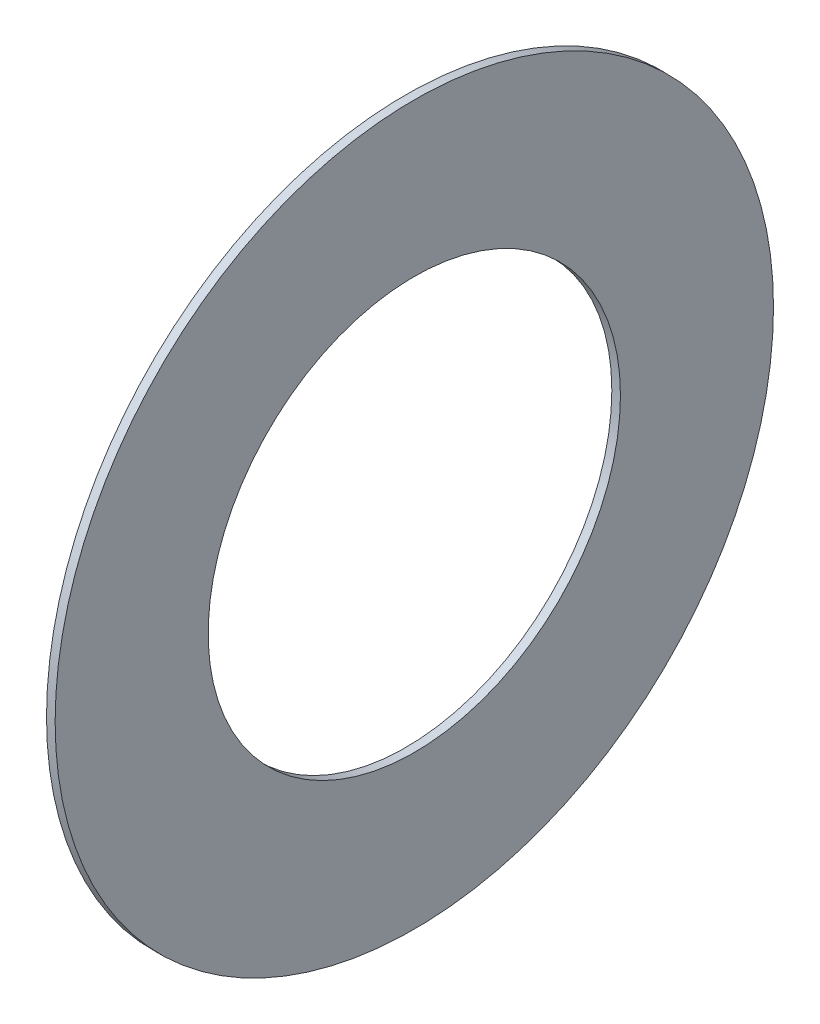
ISO-10303-21;
HEADER;
FILE_DESCRIPTION(('STEP AP214'),'2;1');
FILE_NAME('part.step','',(''),(''),'','','');
FILE_SCHEMA(('AUTOMOTIVE_DESIGN { 1 0 10303 214 1 1 1 1 }'));
ENDSEC;
DATA;
#1=APPLICATION_CONTEXT('core data for automotive mechanical design processes');
#2=APPLICATION_PROTOCOL_DEFINITION('international standard','automotive_design',2000,#1);
#3=PRODUCT_CONTEXT('',#1,'mechanical');
#4=PRODUCT('Part','Part','',(#3));
#5=PRODUCT_RELATED_PRODUCT_CATEGORY('part','',(#4));
#6=PRODUCT_DEFINITION_FORMATION('','',#4);
#7=PRODUCT_DEFINITION_CONTEXT('part definition',#1,'design');
#8=PRODUCT_DEFINITION('design','',#6,#7);
#9=PRODUCT_DEFINITION_SHAPE('','',#8);
#10=(LENGTH_UNIT() NAMED_UNIT(*) SI_UNIT(.MILLI.,.METRE.));
#11=(NAMED_UNIT(*) PLANE_ANGLE_UNIT() SI_UNIT($,.RADIAN.));
#12=(NAMED_UNIT(*) SI_UNIT($,.STERADIAN.) SOLID_ANGLE_UNIT());
#13=UNCERTAINTY_MEASURE_WITH_UNIT(LENGTH_MEASURE(1.E-05),#10,'distance_accuracy_value','');
#14=(GEOMETRIC_REPRESENTATION_CONTEXT(3) GLOBAL_UNCERTAINTY_ASSIGNED_CONTEXT((#13)) GLOBAL_UNIT_ASSIGNED_CONTEXT((#10,
#11,#12)) REPRESENTATION_CONTEXT('',''));
#15=CARTESIAN_POINT('',(0.,0.,0.));
#16=DIRECTION('',(0.,0.,1.));
#17=DIRECTION('',(1.,0.,0.));
#18=AXIS2_PLACEMENT_3D('',#15,#16,#17);
#19=CARTESIAN_POINT('',(0.276,6.6,0.));
#20=DIRECTION('',(1.,0.,0.));
#21=DIRECTION('',(0.,0.,-1.));
#22=AXIS2_PLACEMENT_3D('',#19,#20,#21);
#23=PLANE('',#22);
#24=CARTESIAN_POINT('',(0.276,0.,0.));
#25=DIRECTION('',(1.,0.,0.));
#26=DIRECTION('',(0.,0.,-1.));
#27=AXIS2_PLACEMENT_3D('',#24,#25,#26);
#28=CIRCLE('',#27,6.6);
#29=CARTESIAN_POINT('',(0.276,0.,-6.6));
#30=VERTEX_POINT('',#29);
#31=EDGE_CURVE('E27',#30,#30,#28,.F.);
#32=ORIENTED_EDGE('',*,*,#31,.T.);
#33=EDGE_LOOP('',(#32));
#34=FACE_BOUND('',#33,.T.);
#35=CARTESIAN_POINT('',(0.276,0.,0.));
#36=DIRECTION('',(1.,0.,0.));
#37=DIRECTION('',(0.,0.,-1.));
#38=AXIS2_PLACEMENT_3D('',#35,#36,#37);
#39=CIRCLE('',#38,11.5);
#40=CARTESIAN_POINT('',(0.276,0.,-11.5));
#41=VERTEX_POINT('',#40);
#42=EDGE_CURVE('E18',#41,#41,#39,.F.);
#43=ORIENTED_EDGE('',*,*,#42,.F.);
#44=EDGE_LOOP('',(#43));
#45=FACE_BOUND('',#44,.T.);
#46=ADVANCED_FACE('F15',(#34,#45),#23,.T.);
#47=CARTESIAN_POINT('',(0.138,0.,0.));
#48=DIRECTION('',(1.,0.,0.));
#49=DIRECTION('',(0.,0.,-1.));
#50=AXIS2_PLACEMENT_3D('',#47,#48,#49);
#51=CYLINDRICAL_SURFACE('',#50,11.5);
#52=CARTESIAN_POINT('',(0.,0.,0.));
#53=DIRECTION('',(1.,0.,0.));
#54=DIRECTION('',(0.,0.,-1.));
#55=AXIS2_PLACEMENT_3D('',#52,#53,#54);
#56=CIRCLE('',#55,11.5);
#57=CARTESIAN_POINT('',(0.,0.,-11.5));
#58=VERTEX_POINT('',#57);
#59=EDGE_CURVE('E22',#58,#58,#56,.F.);
#60=ORIENTED_EDGE('',*,*,#59,.F.);
#61=EDGE_LOOP('',(#60));
#62=FACE_BOUND('',#61,.T.);
#63=ORIENTED_EDGE('',*,*,#42,.T.);
#64=EDGE_LOOP('',(#63));
#65=FACE_BOUND('',#64,.T.);
#66=ADVANCED_FACE('F35',(#62,#65),#51,.T.);
#67=CARTESIAN_POINT('',(0.138,0.,0.));
#68=DIRECTION('',(1.,0.,0.));
#69=DIRECTION('',(0.,0.,-1.));
#70=AXIS2_PLACEMENT_3D('',#67,#68,#69);
#71=CYLINDRICAL_SURFACE('',#70,6.6);
#72=ORIENTED_EDGE('',*,*,#31,.F.);
#73=EDGE_LOOP('',(#72));
#74=FACE_BOUND('',#73,.T.);
#75=CARTESIAN_POINT('',(0.,0.,0.));
#76=DIRECTION('',(1.,0.,0.));
#77=DIRECTION('',(0.,0.,-1.));
#78=AXIS2_PLACEMENT_3D('',#75,#76,#77);
#79=CIRCLE('',#78,6.6);
#80=CARTESIAN_POINT('',(0.,0.,-6.6));
#81=VERTEX_POINT('',#80);
#82=EDGE_CURVE('E10',#81,#81,#79,.T.);
#83=ORIENTED_EDGE('',*,*,#82,.F.);
#84=EDGE_LOOP('',(#83));
#85=FACE_BOUND('',#84,.T.);
#86=ADVANCED_FACE('F42',(#74,#85),#71,.F.);
#87=CARTESIAN_POINT('',(0.,11.5,0.));
#88=DIRECTION('',(-1.,0.,0.));
#89=DIRECTION('',(0.,0.,1.));
#90=AXIS2_PLACEMENT_3D('',#87,#88,#89);
#91=PLANE('',#90);
#92=ORIENTED_EDGE('',*,*,#82,.T.);
#93=EDGE_LOOP('',(#92));
#94=FACE_BOUND('',#93,.T.);
#95=ORIENTED_EDGE('',*,*,#59,.T.);
#96=EDGE_LOOP('',(#95));
#97=FACE_BOUND('',#96,.T.);
#98=ADVANCED_FACE('F44',(#94,#97),#91,.T.);
#99=CLOSED_SHELL('',(#46,#66,#86,#98));
#100=MANIFOLD_SOLID_BREP('B1',#99);
#101=ADVANCED_BREP_SHAPE_REPRESENTATION('',(#18,#100),#14);
#102=SHAPE_DEFINITION_REPRESENTATION(#9,#101);
ENDSEC;
END-ISO-10303-21;
